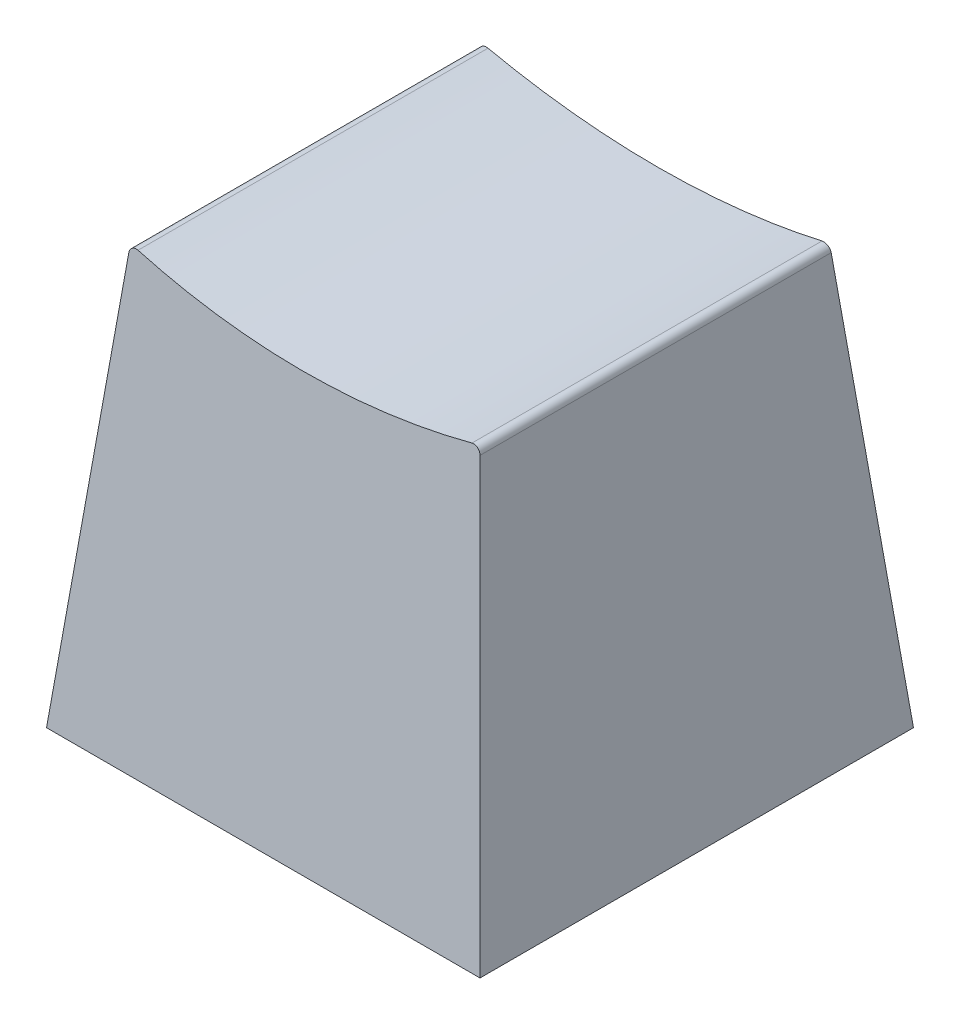
ISO-10303-21;
HEADER;
FILE_DESCRIPTION(('STEP AP214'),'2;1');
FILE_NAME('part.step','',(''),(''),'','','');
FILE_SCHEMA(('AUTOMOTIVE_DESIGN { 1 0 10303 214 1 1 1 1 }'));
ENDSEC;
DATA;
#1=APPLICATION_CONTEXT('core data for automotive mechanical design processes');
#2=APPLICATION_PROTOCOL_DEFINITION('international standard','automotive_design',2000,#1);
#3=PRODUCT_CONTEXT('',#1,'mechanical');
#4=PRODUCT('Part','Part','',(#3));
#5=PRODUCT_RELATED_PRODUCT_CATEGORY('part','',(#4));
#6=PRODUCT_DEFINITION_FORMATION('','',#4);
#7=PRODUCT_DEFINITION_CONTEXT('part definition',#1,'design');
#8=PRODUCT_DEFINITION('design','',#6,#7);
#9=PRODUCT_DEFINITION_SHAPE('','',#8);
#10=(LENGTH_UNIT() NAMED_UNIT(*) SI_UNIT(.MILLI.,.METRE.));
#11=(NAMED_UNIT(*) PLANE_ANGLE_UNIT() SI_UNIT($,.RADIAN.));
#12=(NAMED_UNIT(*) SI_UNIT($,.STERADIAN.) SOLID_ANGLE_UNIT());
#13=UNCERTAINTY_MEASURE_WITH_UNIT(LENGTH_MEASURE(1.E-05),#10,'distance_accuracy_value','');
#14=(GEOMETRIC_REPRESENTATION_CONTEXT(3) GLOBAL_UNCERTAINTY_ASSIGNED_CONTEXT((#13)) GLOBAL_UNIT_ASSIGNED_CONTEXT((#10,
#11,#12)) REPRESENTATION_CONTEXT('',''));
#15=CARTESIAN_POINT('',(0.,0.,0.));
#16=DIRECTION('',(0.,0.,1.));
#17=DIRECTION('',(1.,0.,0.));
#18=AXIS2_PLACEMENT_3D('',#15,#16,#17);
#19=CARTESIAN_POINT('',(0.,0.,0.));
#20=DIRECTION('',(0.,-1.,0.));
#21=DIRECTION('',(0.,0.,-1.));
#22=AXIS2_PLACEMENT_3D('',#19,#20,#21);
#23=PLANE('',#22);
#24=DIRECTION('',(0.,0.,-1.));
#25=VECTOR('',#24,1.);
#26=CARTESIAN_POINT('',(7.874,0.,7.874));
#27=LINE('',#26,#25);
#28=CARTESIAN_POINT('',(7.874,0.,7.874));
#29=VERTEX_POINT('',#28);
#30=CARTESIAN_POINT('',(7.874,0.,-7.874));
#31=VERTEX_POINT('',#30);
#32=EDGE_CURVE('E134',#29,#31,#27,.T.);
#33=ORIENTED_EDGE('',*,*,#32,.F.);
#34=DIRECTION('',(1.,0.,0.));
#35=VECTOR('',#34,1.);
#36=CARTESIAN_POINT('',(-7.874,0.,7.874));
#37=LINE('',#36,#35);
#38=CARTESIAN_POINT('',(-7.874,0.,7.874));
#39=VERTEX_POINT('',#38);
#40=EDGE_CURVE('E125',#39,#29,#37,.T.);
#41=ORIENTED_EDGE('',*,*,#40,.F.);
#42=DIRECTION('',(0.,0.,1.));
#43=VECTOR('',#42,1.);
#44=CARTESIAN_POINT('',(-7.874,0.,7.874));
#45=LINE('',#44,#43);
#46=CARTESIAN_POINT('',(-7.874,0.,-7.874));
#47=VERTEX_POINT('',#46);
#48=EDGE_CURVE('E107',#47,#39,#45,.T.);
#49=ORIENTED_EDGE('',*,*,#48,.F.);
#50=DIRECTION('',(-1.,0.,0.));
#51=VECTOR('',#50,1.);
#52=CARTESIAN_POINT('',(-7.874,0.,-7.874));
#53=LINE('',#52,#51);
#54=EDGE_CURVE('E121',#31,#47,#53,.T.);
#55=ORIENTED_EDGE('',*,*,#54,.F.);
#56=EDGE_LOOP('',(#33,#41,#49,#55));
#57=FACE_BOUND('',#56,.T.);
#58=ADVANCED_FACE('F51',(#57),#23,.T.);
#59=CARTESIAN_POINT('',(-7.7960396039604,0.779603960396041,0.));
#60=DIRECTION('',(-0.995037190209989,0.099503719020999,0.));
#61=DIRECTION('',(-0.099503719020999,-0.995037190209989,0.));
#62=AXIS2_PLACEMENT_3D('',#59,#60,#61);
#63=PLANE('',#62);
#64=DIRECTION('',(-0.0990147542976675,-0.990147542976674,0.0990147542976673));
#65=VECTOR('',#64,1.);
#66=CARTESIAN_POINT('',(-6.35,15.24,6.35));
#67=LINE('',#66,#65);
#68=CARTESIAN_POINT('',(-6.37929856696182,14.9470143303818,6.37929856696182));
#69=VERTEX_POINT('',#68);
#70=EDGE_CURVE('E113',#69,#39,#67,.T.);
#71=ORIENTED_EDGE('',*,*,#70,.F.);
#72=DIRECTION('',(0.,0.,-1.));
#73=VECTOR('',#72,1.);
#74=CARTESIAN_POINT('',(-6.37929856696182,14.9470143303818,0.));
#75=LINE('',#74,#73);
#76=CARTESIAN_POINT('',(-6.37929856696182,14.9470143303818,-6.37929856696182));
#77=VERTEX_POINT('',#76);
#78=EDGE_CURVE('E12',#69,#77,#75,.T.);
#79=ORIENTED_EDGE('',*,*,#78,.T.);
#80=DIRECTION('',(-0.0990147542976675,-0.990147542976674,-0.0990147542976675));
#81=VECTOR('',#80,1.);
#82=CARTESIAN_POINT('',(-6.35,15.24,-6.35));
#83=LINE('',#82,#81);
#84=EDGE_CURVE('E104',#77,#47,#83,.T.);
#85=ORIENTED_EDGE('',*,*,#84,.T.);
#86=ORIENTED_EDGE('',*,*,#48,.T.);
#87=EDGE_LOOP('',(#71,#79,#85,#86));
#88=FACE_BOUND('',#87,.T.);
#89=ADVANCED_FACE('F106',(#88),#63,.T.);
#90=CARTESIAN_POINT('',(0.,0.779603960396038,7.7960396039604));
#91=DIRECTION('',(0.,0.0995037190209988,0.995037190209989));
#92=DIRECTION('',(0.,-0.995037190209989,0.0995037190209988));
#93=AXIS2_PLACEMENT_3D('',#90,#91,#92);
#94=PLANE('',#93);
#95=DIRECTION('',(0.0990147542976672,-0.990147542976674,0.0990147542976673));
#96=VECTOR('',#95,1.);
#97=CARTESIAN_POINT('',(6.35,15.24,6.35));
#98=LINE('',#97,#96);
#99=CARTESIAN_POINT('',(6.37929856696182,14.9470143303818,6.37929856696182));
#100=VERTEX_POINT('',#99);
#101=EDGE_CURVE('E218',#100,#29,#98,.T.);
#102=ORIENTED_EDGE('',*,*,#101,.F.);
#103=CARTESIAN_POINT('',(6.12655912064848,14.9217403857505,6.38182596142495));
#104=DIRECTION('',(0.,0.0995037190209988,0.995037190209989));
#105=DIRECTION('',(0.,0.995037190209989,-0.0995037190209988));
#106=AXIS2_PLACEMENT_3D('',#103,#104,#105);
#107=ELLIPSE('',#106,0.255266840776471,0.254);
#108=CARTESIAN_POINT('',(6.06590011945393,15.1683909190442,6.35716090809558));
#109=VERTEX_POINT('',#108);
#110=EDGE_CURVE('E59',#100,#109,#107,.T.);
#111=ORIENTED_EDGE('',*,*,#110,.T.);
#112=CARTESIAN_POINT('',(0.,39.8334442484171,3.8906555751583));
#113=DIRECTION('',(0.,0.0995037190209988,0.995037190209989));
#114=DIRECTION('',(0.,0.995037190209989,-0.0995037190209988));
#115=AXIS2_PLACEMENT_3D('',#112,#113,#114);
#116=ELLIPSE('',#115,25.5266840776471,25.4);
#117=CARTESIAN_POINT('',(-6.06590011945394,15.1683909190442,6.35716090809558));
#118=VERTEX_POINT('',#117);
#119=EDGE_CURVE('E114',#109,#118,#116,.F.);
#120=ORIENTED_EDGE('',*,*,#119,.T.);
#121=CARTESIAN_POINT('',(-6.12655912064849,14.9217403857505,6.38182596142495));
#122=DIRECTION('',(0.,0.0995037190209988,0.995037190209989));
#123=DIRECTION('',(0.,0.995037190209989,-0.0995037190209988));
#124=AXIS2_PLACEMENT_3D('',#121,#122,#123);
#125=ELLIPSE('',#124,0.255266840776471,0.254);
#126=EDGE_CURVE('E66',#118,#69,#125,.T.);
#127=ORIENTED_EDGE('',*,*,#126,.T.);
#128=ORIENTED_EDGE('',*,*,#70,.T.);
#129=ORIENTED_EDGE('',*,*,#40,.T.);
#130=EDGE_LOOP('',(#102,#111,#120,#127,#128,#129));
#131=FACE_BOUND('',#130,.T.);
#132=ADVANCED_FACE('F156',(#131),#94,.T.);
#133=CARTESIAN_POINT('',(0.,0.779603960396039,-7.7960396039604));
#134=DIRECTION('',(0.,0.0995037190209989,-0.995037190209989));
#135=DIRECTION('',(0.,0.995037190209989,0.0995037190209989));
#136=AXIS2_PLACEMENT_3D('',#133,#134,#135);
#137=PLANE('',#136);
#138=CARTESIAN_POINT('',(0.,39.8334442484171,-3.89065557515829));
#139=DIRECTION('',(0.,0.0995037190209989,-0.995037190209989));
#140=DIRECTION('',(0.,-0.995037190209989,-0.0995037190209989));
#141=AXIS2_PLACEMENT_3D('',#138,#139,#140);
#142=ELLIPSE('',#141,25.5266840776471,25.4);
#143=CARTESIAN_POINT('',(-6.06590011945394,15.1683909190442,-6.35716090809558));
#144=VERTEX_POINT('',#143);
#145=CARTESIAN_POINT('',(6.06590011945395,15.1683909190442,-6.35716090809558));
#146=VERTEX_POINT('',#145);
#147=EDGE_CURVE('E202',#144,#146,#142,.F.);
#148=ORIENTED_EDGE('',*,*,#147,.T.);
#149=CARTESIAN_POINT('',(6.12655912064848,14.9217403857505,-6.38182596142495));
#150=DIRECTION('',(0.,0.0995037190209989,-0.995037190209989));
#151=DIRECTION('',(0.,-0.995037190209989,-0.0995037190209989));
#152=AXIS2_PLACEMENT_3D('',#149,#150,#151);
#153=ELLIPSE('',#152,0.255266840776471,0.254);
#154=CARTESIAN_POINT('',(6.37929856696182,14.9470143303818,-6.37929856696182));
#155=VERTEX_POINT('',#154);
#156=EDGE_CURVE('E228',#146,#155,#153,.T.);
#157=ORIENTED_EDGE('',*,*,#156,.T.);
#158=DIRECTION('',(0.0990147542976672,-0.990147542976674,-0.0990147542976674));
#159=VECTOR('',#158,1.);
#160=CARTESIAN_POINT('',(6.35,15.24,-6.35));
#161=LINE('',#160,#159);
#162=EDGE_CURVE('E133',#155,#31,#161,.T.);
#163=ORIENTED_EDGE('',*,*,#162,.T.);
#164=ORIENTED_EDGE('',*,*,#54,.T.);
#165=ORIENTED_EDGE('',*,*,#84,.F.);
#166=CARTESIAN_POINT('',(-6.12655912064849,14.9217403857505,-6.38182596142495));
#167=DIRECTION('',(0.,0.0995037190209989,-0.995037190209989));
#168=DIRECTION('',(0.,-0.995037190209989,-0.0995037190209989));
#169=AXIS2_PLACEMENT_3D('',#166,#167,#168);
#170=ELLIPSE('',#169,0.255266840776471,0.254);
#171=EDGE_CURVE('E229',#77,#144,#170,.T.);
#172=ORIENTED_EDGE('',*,*,#171,.T.);
#173=EDGE_LOOP('',(#148,#157,#163,#164,#165,#172));
#174=FACE_BOUND('',#173,.T.);
#175=ADVANCED_FACE('F132',(#174),#137,.T.);
#176=CARTESIAN_POINT('',(7.79603960396039,0.779603960396038,0.));
#177=DIRECTION('',(0.995037190209989,0.0995037190209987,0.));
#178=DIRECTION('',(-0.0995037190209987,0.995037190209989,0.));
#179=AXIS2_PLACEMENT_3D('',#176,#177,#178);
#180=PLANE('',#179);
#181=ORIENTED_EDGE('',*,*,#162,.F.);
#182=DIRECTION('',(0.,0.,-1.));
#183=VECTOR('',#182,1.);
#184=CARTESIAN_POINT('',(6.37929856696182,14.9470143303818,0.));
#185=LINE('',#184,#183);
#186=EDGE_CURVE('E74',#155,#100,#185,.F.);
#187=ORIENTED_EDGE('',*,*,#186,.T.);
#188=ORIENTED_EDGE('',*,*,#101,.T.);
#189=ORIENTED_EDGE('',*,*,#32,.T.);
#190=EDGE_LOOP('',(#181,#187,#188,#189));
#191=FACE_BOUND('',#190,.T.);
#192=ADVANCED_FACE('F155',(#191),#180,.T.);
#193=CARTESIAN_POINT('',(0.,39.8334442484171,43.5757204241976));
#194=DIRECTION('',(0.,0.,-1.));
#195=DIRECTION('',(-1.,0.,0.));
#196=AXIS2_PLACEMENT_3D('',#193,#194,#195);
#197=CYLINDRICAL_SURFACE('',#196,25.4);
#198=ORIENTED_EDGE('',*,*,#119,.F.);
#199=DIRECTION('',(0.,0.,-1.));
#200=VECTOR('',#199,1.);
#201=CARTESIAN_POINT('',(6.06590011945394,15.1683909190442,43.5757204241976));
#202=LINE('',#201,#200);
#203=EDGE_CURVE('E225',#109,#146,#202,.T.);
#204=ORIENTED_EDGE('',*,*,#203,.T.);
#205=ORIENTED_EDGE('',*,*,#147,.F.);
#206=DIRECTION('',(0.,0.,-1.));
#207=VECTOR('',#206,1.);
#208=CARTESIAN_POINT('',(-6.06590011945394,15.1683909190442,43.5757204241976));
#209=LINE('',#208,#207);
#210=EDGE_CURVE('E175',#144,#118,#209,.F.);
#211=ORIENTED_EDGE('',*,*,#210,.T.);
#212=EDGE_LOOP('',(#198,#204,#205,#211));
#213=FACE_BOUND('',#212,.T.);
#214=ADVANCED_FACE('F161',(#213),#197,.F.);
#215=CARTESIAN_POINT('',(6.12655912064848,14.9217403857505,43.5757204241976));
#216=DIRECTION('',(0.,0.,-1.));
#217=DIRECTION('',(-1.,0.,0.));
#218=AXIS2_PLACEMENT_3D('',#215,#216,#217);
#219=CYLINDRICAL_SURFACE('',#218,0.254);
#220=ORIENTED_EDGE('',*,*,#110,.F.);
#221=ORIENTED_EDGE('',*,*,#186,.F.);
#222=ORIENTED_EDGE('',*,*,#156,.F.);
#223=ORIENTED_EDGE('',*,*,#203,.F.);
#224=EDGE_LOOP('',(#220,#221,#222,#223));
#225=FACE_BOUND('',#224,.T.);
#226=ADVANCED_FACE('F227',(#225),#219,.T.);
#227=CARTESIAN_POINT('',(-6.12655912064849,14.9217403857505,43.5757204241976));
#228=DIRECTION('',(0.,0.,-1.));
#229=DIRECTION('',(-1.,0.,0.));
#230=AXIS2_PLACEMENT_3D('',#227,#228,#229);
#231=CYLINDRICAL_SURFACE('',#230,0.254);
#232=ORIENTED_EDGE('',*,*,#171,.F.);
#233=ORIENTED_EDGE('',*,*,#78,.F.);
#234=ORIENTED_EDGE('',*,*,#126,.F.);
#235=ORIENTED_EDGE('',*,*,#210,.F.);
#236=EDGE_LOOP('',(#232,#233,#234,#235));
#237=FACE_BOUND('',#236,.T.);
#238=ADVANCED_FACE('F53',(#237),#231,.T.);
#239=CLOSED_SHELL('',(#58,#89,#132,#175,#192,#214,#226,#238));
#240=MANIFOLD_SOLID_BREP('B2',#239);
#241=ADVANCED_BREP_SHAPE_REPRESENTATION('',(#18,#240),#14);
#242=SHAPE_DEFINITION_REPRESENTATION(#9,#241);
ENDSEC;
END-ISO-10303-21;
